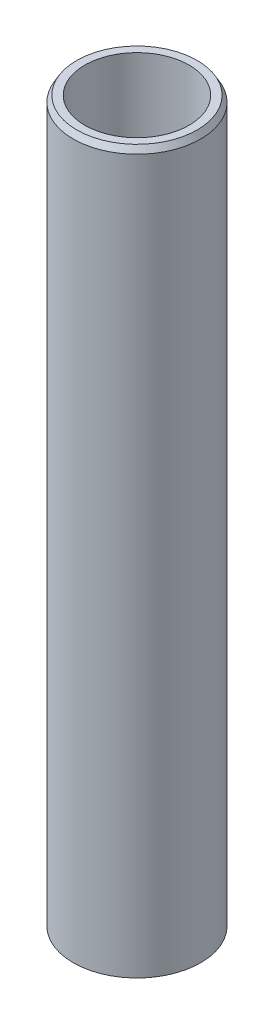
ISO-10303-21;
HEADER;
FILE_DESCRIPTION(('STEP AP214'),'2;1');
FILE_NAME('part.step','',(''),(''),'','','');
FILE_SCHEMA(('AUTOMOTIVE_DESIGN { 1 0 10303 214 1 1 1 1 }'));
ENDSEC;
DATA;
#1=APPLICATION_CONTEXT('core data for automotive mechanical design processes');
#2=APPLICATION_PROTOCOL_DEFINITION('international standard','automotive_design',2000,#1);
#3=PRODUCT_CONTEXT('',#1,'mechanical');
#4=PRODUCT('Part','Part','',(#3));
#5=PRODUCT_RELATED_PRODUCT_CATEGORY('part','',(#4));
#6=PRODUCT_DEFINITION_FORMATION('','',#4);
#7=PRODUCT_DEFINITION_CONTEXT('part definition',#1,'design');
#8=PRODUCT_DEFINITION('design','',#6,#7);
#9=PRODUCT_DEFINITION_SHAPE('','',#8);
#10=(LENGTH_UNIT() NAMED_UNIT(*) SI_UNIT(.MILLI.,.METRE.));
#11=(NAMED_UNIT(*) PLANE_ANGLE_UNIT() SI_UNIT($,.RADIAN.));
#12=(NAMED_UNIT(*) SI_UNIT($,.STERADIAN.) SOLID_ANGLE_UNIT());
#13=UNCERTAINTY_MEASURE_WITH_UNIT(LENGTH_MEASURE(1.E-05),#10,'distance_accuracy_value','');
#14=(GEOMETRIC_REPRESENTATION_CONTEXT(3) GLOBAL_UNCERTAINTY_ASSIGNED_CONTEXT((#13)) GLOBAL_UNIT_ASSIGNED_CONTEXT((#10,
#11,#12)) REPRESENTATION_CONTEXT('',''));
#15=CARTESIAN_POINT('',(0.,0.,0.));
#16=DIRECTION('',(0.,0.,1.));
#17=DIRECTION('',(1.,0.,0.));
#18=AXIS2_PLACEMENT_3D('',#15,#16,#17);
#19=CARTESIAN_POINT('',(0.,340.24724608038,0.));
#20=DIRECTION('',(0.,-1.,0.));
#21=DIRECTION('',(0.,0.,-1.));
#22=AXIS2_PLACEMENT_3D('',#19,#20,#21);
#23=CYLINDRICAL_SURFACE('',#22,30.);
#24=CARTESIAN_POINT('',(0.,337.375067519885,0.));
#25=DIRECTION('',(0.,1.,0.));
#26=DIRECTION('',(0.,0.,1.));
#27=AXIS2_PLACEMENT_3D('',#24,#25,#26);
#28=CIRCLE('',#27,30.);
#29=CARTESIAN_POINT('',(0.,337.375067519885,30.));
#30=VERTEX_POINT('',#29);
#31=EDGE_CURVE('E50',#30,#30,#28,.F.);
#32=ORIENTED_EDGE('',*,*,#31,.T.);
#33=EDGE_LOOP('',(#32));
#34=FACE_BOUND('',#33,.T.);
#35=CARTESIAN_POINT('',(0.,1.65825306506201,0.));
#36=DIRECTION('',(0.,1.,0.));
#37=DIRECTION('',(0.,0.,1.));
#38=AXIS2_PLACEMENT_3D('',#35,#36,#37);
#39=CIRCLE('',#38,30.);
#40=CARTESIAN_POINT('',(0.,1.65825306506201,30.));
#41=VERTEX_POINT('',#40);
#42=EDGE_CURVE('E51',#41,#41,#39,.T.);
#43=ORIENTED_EDGE('',*,*,#42,.T.);
#44=EDGE_LOOP('',(#43));
#45=FACE_BOUND('',#44,.T.);
#46=ADVANCED_FACE('F39',(#34,#45),#23,.T.);
#47=CARTESIAN_POINT('',(0.,340.24724608038,0.));
#48=DIRECTION('',(0.,1.,0.));
#49=DIRECTION('',(0.,0.,1.));
#50=AXIS2_PLACEMENT_3D('',#47,#48,#49);
#51=PLANE('',#50);
#52=CARTESIAN_POINT('',(0.,340.24724608038,0.));
#53=DIRECTION('',(0.,1.,0.));
#54=DIRECTION('',(0.,0.,1.));
#55=AXIS2_PLACEMENT_3D('',#52,#53,#54);
#56=CIRCLE('',#55,28.3417469349379);
#57=CARTESIAN_POINT('',(0.,340.24724608038,28.3417469349379));
#58=VERTEX_POINT('',#57);
#59=EDGE_CURVE('E54',#58,#58,#56,.T.);
#60=ORIENTED_EDGE('',*,*,#59,.T.);
#61=EDGE_LOOP('',(#60));
#62=FACE_BOUND('',#61,.T.);
#63=CARTESIAN_POINT('',(0.,340.24724608038,0.));
#64=DIRECTION('',(0.,1.,0.));
#65=DIRECTION('',(0.,0.,1.));
#66=AXIS2_PLACEMENT_3D('',#63,#64,#65);
#67=CIRCLE('',#66,24.5488105850671);
#68=CARTESIAN_POINT('',(0.,340.24724608038,24.5488105850671));
#69=VERTEX_POINT('',#68);
#70=EDGE_CURVE('E58',#69,#69,#67,.T.);
#71=ORIENTED_EDGE('',*,*,#70,.F.);
#72=EDGE_LOOP('',(#71));
#73=FACE_BOUND('',#72,.T.);
#74=ADVANCED_FACE('F69',(#62,#73),#51,.T.);
#75=CARTESIAN_POINT('',(0.,0.,0.));
#76=DIRECTION('',(0.,1.,0.));
#77=DIRECTION('',(0.,0.,1.));
#78=AXIS2_PLACEMENT_3D('',#75,#76,#77);
#79=PLANE('',#78);
#80=CARTESIAN_POINT('',(0.,0.,0.));
#81=DIRECTION('',(0.,1.,0.));
#82=DIRECTION('',(0.,0.,1.));
#83=AXIS2_PLACEMENT_3D('',#80,#81,#82);
#84=CIRCLE('',#83,27.1278214395058);
#85=CARTESIAN_POINT('',(0.,0.,27.1278214395058));
#86=VERTEX_POINT('',#85);
#87=EDGE_CURVE('E10',#86,#86,#84,.F.);
#88=ORIENTED_EDGE('',*,*,#87,.T.);
#89=EDGE_LOOP('',(#88));
#90=FACE_BOUND('',#89,.T.);
#91=CARTESIAN_POINT('',(0.,0.,0.));
#92=DIRECTION('',(0.,1.,0.));
#93=DIRECTION('',(0.,0.,1.));
#94=AXIS2_PLACEMENT_3D('',#91,#92,#93);
#95=CIRCLE('',#94,24.5488105850671);
#96=CARTESIAN_POINT('',(0.,0.,24.5488105850671));
#97=VERTEX_POINT('',#96);
#98=EDGE_CURVE('E63',#97,#97,#95,.T.);
#99=ORIENTED_EDGE('',*,*,#98,.T.);
#100=EDGE_LOOP('',(#99));
#101=FACE_BOUND('',#100,.T.);
#102=ADVANCED_FACE('F75',(#90,#101),#79,.F.);
#103=CARTESIAN_POINT('',(0.,340.24724608038,0.));
#104=DIRECTION('',(0.,-1.,0.));
#105=DIRECTION('',(0.,0.,-1.));
#106=AXIS2_PLACEMENT_3D('',#103,#104,#105);
#107=CYLINDRICAL_SURFACE('',#106,24.5488105850671);
#108=ORIENTED_EDGE('',*,*,#70,.T.);
#109=EDGE_LOOP('',(#108));
#110=FACE_BOUND('',#109,.T.);
#111=ORIENTED_EDGE('',*,*,#98,.F.);
#112=EDGE_LOOP('',(#111));
#113=FACE_BOUND('',#112,.T.);
#114=ADVANCED_FACE('F70',(#110,#113),#107,.F.);
#115=CARTESIAN_POINT('',(0.,340.24724608038,0.));
#116=DIRECTION('',(0.,-1.,0.));
#117=DIRECTION('',(0.,0.,-1.));
#118=AXIS2_PLACEMENT_3D('',#115,#116,#117);
#119=CONICAL_SURFACE('',#118,28.3417469349379,0.523598775598307);
#120=ORIENTED_EDGE('',*,*,#31,.F.);
#121=EDGE_LOOP('',(#120));
#122=FACE_BOUND('',#121,.T.);
#123=ORIENTED_EDGE('',*,*,#59,.F.);
#124=EDGE_LOOP('',(#123));
#125=FACE_BOUND('',#124,.T.);
#126=ADVANCED_FACE('F81',(#122,#125),#119,.T.);
#127=CARTESIAN_POINT('',(0.,1.65825306506201,0.));
#128=DIRECTION('',(0.,1.,0.));
#129=DIRECTION('',(0.,0.,1.));
#130=AXIS2_PLACEMENT_3D('',#127,#128,#129);
#131=CONICAL_SURFACE('',#130,30.,1.04719755119659);
#132=ORIENTED_EDGE('',*,*,#87,.F.);
#133=EDGE_LOOP('',(#132));
#134=FACE_BOUND('',#133,.T.);
#135=ORIENTED_EDGE('',*,*,#42,.F.);
#136=EDGE_LOOP('',(#135));
#137=FACE_BOUND('',#136,.T.);
#138=ADVANCED_FACE('F45',(#134,#137),#131,.T.);
#139=CLOSED_SHELL('',(#46,#74,#102,#114,#126,#138));
#140=MANIFOLD_SOLID_BREP('B2',#139);
#141=ADVANCED_BREP_SHAPE_REPRESENTATION('',(#18,#140),#14);
#142=SHAPE_DEFINITION_REPRESENTATION(#9,#141);
ENDSEC;
END-ISO-10303-21;
